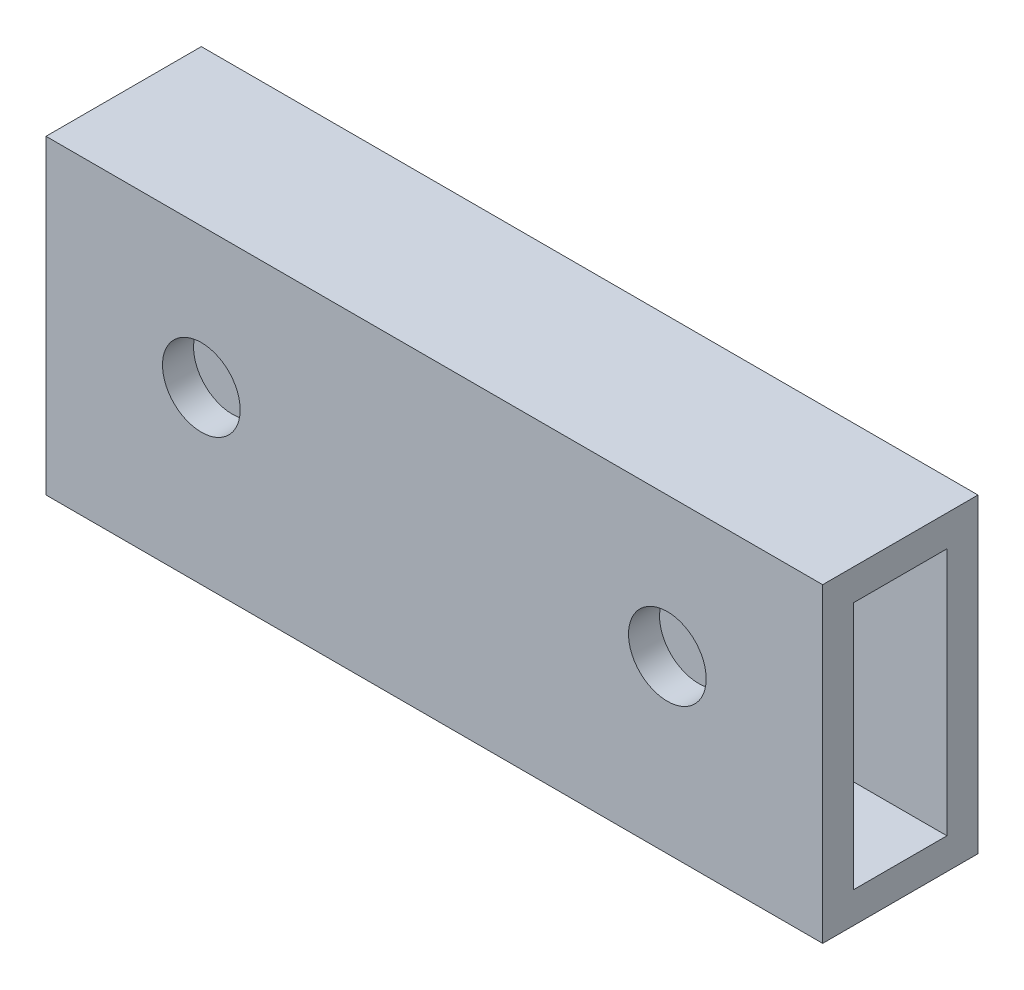
ISO-10303-21;
HEADER;
FILE_DESCRIPTION(('STEP AP214'),'2;1');
FILE_NAME('part.step','',(''),(''),'','','');
FILE_SCHEMA(('AUTOMOTIVE_DESIGN { 1 0 10303 214 1 1 1 1 }'));
ENDSEC;
DATA;
#1=APPLICATION_CONTEXT('core data for automotive mechanical design processes');
#2=APPLICATION_PROTOCOL_DEFINITION('international standard','automotive_design',2000,#1);
#3=PRODUCT_CONTEXT('',#1,'mechanical');
#4=PRODUCT('Part','Part','',(#3));
#5=PRODUCT_RELATED_PRODUCT_CATEGORY('part','',(#4));
#6=PRODUCT_DEFINITION_FORMATION('','',#4);
#7=PRODUCT_DEFINITION_CONTEXT('part definition',#1,'design');
#8=PRODUCT_DEFINITION('design','',#6,#7);
#9=PRODUCT_DEFINITION_SHAPE('','',#8);
#10=(LENGTH_UNIT() NAMED_UNIT(*) SI_UNIT(.MILLI.,.METRE.));
#11=(NAMED_UNIT(*) PLANE_ANGLE_UNIT() SI_UNIT($,.RADIAN.));
#12=(NAMED_UNIT(*) SI_UNIT($,.STERADIAN.) SOLID_ANGLE_UNIT());
#13=UNCERTAINTY_MEASURE_WITH_UNIT(LENGTH_MEASURE(1.E-05),#10,'distance_accuracy_value','');
#14=(GEOMETRIC_REPRESENTATION_CONTEXT(3) GLOBAL_UNCERTAINTY_ASSIGNED_CONTEXT((#13)) GLOBAL_UNIT_ASSIGNED_CONTEXT((#10,
#11,#12)) REPRESENTATION_CONTEXT('',''));
#15=CARTESIAN_POINT('',(0.,0.,0.));
#16=DIRECTION('',(0.,0.,1.));
#17=DIRECTION('',(1.,0.,0.));
#18=AXIS2_PLACEMENT_3D('',#15,#16,#17);
#19=CARTESIAN_POINT('',(-96.1386740943104,114.333988554593,10.));
#20=DIRECTION('',(1.,0.,0.));
#21=DIRECTION('',(0.,0.,-1.));
#22=AXIS2_PLACEMENT_3D('',#19,#20,#21);
#23=PLANE('',#22);
#24=DIRECTION('',(0.,0.,-1.));
#25=VECTOR('',#24,1.);
#26=CARTESIAN_POINT('',(-96.1386740943104,132.333988554593,8.));
#27=LINE('',#26,#25);
#28=CARTESIAN_POINT('',(-96.1386740943104,132.333988554593,8.));
#29=VERTEX_POINT('',#28);
#30=CARTESIAN_POINT('',(-96.1386740943104,132.333988554593,2.));
#31=VERTEX_POINT('',#30);
#32=EDGE_CURVE('E113',#29,#31,#27,.T.);
#33=ORIENTED_EDGE('',*,*,#32,.F.);
#34=DIRECTION('',(0.,1.,0.));
#35=VECTOR('',#34,1.);
#36=CARTESIAN_POINT('',(-96.1386740943104,132.333988554593,8.));
#37=LINE('',#36,#35);
#38=CARTESIAN_POINT('',(-96.1386740943104,116.333988554593,8.));
#39=VERTEX_POINT('',#38);
#40=EDGE_CURVE('E51',#39,#29,#37,.T.);
#41=ORIENTED_EDGE('',*,*,#40,.F.);
#42=DIRECTION('',(0.,0.,1.));
#43=VECTOR('',#42,1.);
#44=CARTESIAN_POINT('',(-96.1386740943104,116.333988554593,8.));
#45=LINE('',#44,#43);
#46=CARTESIAN_POINT('',(-96.1386740943104,116.333988554593,2.));
#47=VERTEX_POINT('',#46);
#48=EDGE_CURVE('E119',#47,#39,#45,.T.);
#49=ORIENTED_EDGE('',*,*,#48,.F.);
#50=DIRECTION('',(0.,-1.,0.));
#51=VECTOR('',#50,1.);
#52=CARTESIAN_POINT('',(-96.1386740943104,132.333988554593,2.));
#53=LINE('',#52,#51);
#54=EDGE_CURVE('E104',#31,#47,#53,.T.);
#55=ORIENTED_EDGE('',*,*,#54,.F.);
#56=EDGE_LOOP('',(#33,#41,#49,#55));
#57=FACE_BOUND('',#56,.T.);
#58=DIRECTION('',(0.,-1.,0.));
#59=VECTOR('',#58,1.);
#60=CARTESIAN_POINT('',(-96.1386740943104,114.333988554593,0.));
#61=LINE('',#60,#59);
#62=CARTESIAN_POINT('',(-96.1386740943104,134.333988554593,0.));
#63=VERTEX_POINT('',#62);
#64=CARTESIAN_POINT('',(-96.1386740943104,114.333988554593,0.));
#65=VERTEX_POINT('',#64);
#66=EDGE_CURVE('E126',#63,#65,#61,.T.);
#67=ORIENTED_EDGE('',*,*,#66,.T.);
#68=DIRECTION('',(0.,0.,-1.));
#69=VECTOR('',#68,1.);
#70=CARTESIAN_POINT('',(-96.1386740943104,114.333988554593,10.));
#71=LINE('',#70,#69);
#72=CARTESIAN_POINT('',(-96.1386740943104,114.333988554593,10.));
#73=VERTEX_POINT('',#72);
#74=EDGE_CURVE('E155',#73,#65,#71,.T.);
#75=ORIENTED_EDGE('',*,*,#74,.F.);
#76=DIRECTION('',(0.,-1.,0.));
#77=VECTOR('',#76,1.);
#78=CARTESIAN_POINT('',(-96.1386740943104,114.333988554593,10.));
#79=LINE('',#78,#77);
#80=CARTESIAN_POINT('',(-96.1386740943104,134.333988554593,10.));
#81=VERTEX_POINT('',#80);
#82=EDGE_CURVE('E129',#81,#73,#79,.T.);
#83=ORIENTED_EDGE('',*,*,#82,.F.);
#84=DIRECTION('',(0.,0.,-1.));
#85=VECTOR('',#84,1.);
#86=CARTESIAN_POINT('',(-96.1386740943104,134.333988554593,10.));
#87=LINE('',#86,#85);
#88=EDGE_CURVE('E139',#81,#63,#87,.T.);
#89=ORIENTED_EDGE('',*,*,#88,.T.);
#90=EDGE_LOOP('',(#67,#75,#83,#89));
#91=FACE_BOUND('',#90,.T.);
#92=ADVANCED_FACE('F35',(#57,#91),#23,.F.);
#93=CARTESIAN_POINT('',(-96.1386740943104,114.333988554593,10.));
#94=DIRECTION('',(0.,1.,0.));
#95=DIRECTION('',(0.,0.,1.));
#96=AXIS2_PLACEMENT_3D('',#93,#94,#95);
#97=PLANE('',#96);
#98=DIRECTION('',(1.,0.,0.));
#99=VECTOR('',#98,1.);
#100=CARTESIAN_POINT('',(-96.1386740943104,114.333988554593,0.));
#101=LINE('',#100,#99);
#102=CARTESIAN_POINT('',(-46.1386740943102,114.333988554593,0.));
#103=VERTEX_POINT('',#102);
#104=EDGE_CURVE('E142',#65,#103,#101,.T.);
#105=ORIENTED_EDGE('',*,*,#104,.T.);
#106=DIRECTION('',(0.,0.,-1.));
#107=VECTOR('',#106,1.);
#108=CARTESIAN_POINT('',(-46.1386740943102,114.333988554593,10.));
#109=LINE('',#108,#107);
#110=CARTESIAN_POINT('',(-46.1386740943102,114.333988554593,10.));
#111=VERTEX_POINT('',#110);
#112=EDGE_CURVE('E152',#111,#103,#109,.T.);
#113=ORIENTED_EDGE('',*,*,#112,.F.);
#114=DIRECTION('',(1.,0.,0.));
#115=VECTOR('',#114,1.);
#116=CARTESIAN_POINT('',(-96.1386740943104,114.333988554593,10.));
#117=LINE('',#116,#115);
#118=EDGE_CURVE('E132',#73,#111,#117,.T.);
#119=ORIENTED_EDGE('',*,*,#118,.F.);
#120=ORIENTED_EDGE('',*,*,#74,.T.);
#121=EDGE_LOOP('',(#105,#113,#119,#120));
#122=FACE_BOUND('',#121,.T.);
#123=ADVANCED_FACE('F214',(#122),#97,.F.);
#124=CARTESIAN_POINT('',(-46.1386740943102,114.333988554593,10.));
#125=DIRECTION('',(-1.,0.,0.));
#126=DIRECTION('',(0.,0.,1.));
#127=AXIS2_PLACEMENT_3D('',#124,#125,#126);
#128=PLANE('',#127);
#129=DIRECTION('',(0.,0.,1.));
#130=VECTOR('',#129,1.);
#131=CARTESIAN_POINT('',(-46.1386740943102,116.333988554593,10.));
#132=LINE('',#131,#130);
#133=CARTESIAN_POINT('',(-46.1386740943102,116.333988554593,2.));
#134=VERTEX_POINT('',#133);
#135=CARTESIAN_POINT('',(-46.1386740943102,116.333988554593,8.));
#136=VERTEX_POINT('',#135);
#137=EDGE_CURVE('E43',#134,#136,#132,.T.);
#138=ORIENTED_EDGE('',*,*,#137,.T.);
#139=DIRECTION('',(0.,1.,0.));
#140=VECTOR('',#139,1.);
#141=CARTESIAN_POINT('',(-46.1386740943102,114.333988554593,8.));
#142=LINE('',#141,#140);
#143=CARTESIAN_POINT('',(-46.1386740943102,132.333988554593,8.));
#144=VERTEX_POINT('',#143);
#145=EDGE_CURVE('E11',#136,#144,#142,.T.);
#146=ORIENTED_EDGE('',*,*,#145,.T.);
#147=DIRECTION('',(0.,0.,-1.));
#148=VECTOR('',#147,1.);
#149=CARTESIAN_POINT('',(-46.1386740943102,132.333988554593,10.));
#150=LINE('',#149,#148);
#151=CARTESIAN_POINT('',(-46.1386740943102,132.333988554593,2.));
#152=VERTEX_POINT('',#151);
#153=EDGE_CURVE('E158',#144,#152,#150,.T.);
#154=ORIENTED_EDGE('',*,*,#153,.T.);
#155=DIRECTION('',(0.,-1.,0.));
#156=VECTOR('',#155,1.);
#157=CARTESIAN_POINT('',(-46.1386740943102,114.333988554593,2.));
#158=LINE('',#157,#156);
#159=EDGE_CURVE('E107',#152,#134,#158,.T.);
#160=ORIENTED_EDGE('',*,*,#159,.T.);
#161=EDGE_LOOP('',(#138,#146,#154,#160));
#162=FACE_BOUND('',#161,.T.);
#163=DIRECTION('',(0.,1.,0.));
#164=VECTOR('',#163,1.);
#165=CARTESIAN_POINT('',(-46.1386740943102,114.333988554593,0.));
#166=LINE('',#165,#164);
#167=CARTESIAN_POINT('',(-46.1386740943102,134.333988554593,0.));
#168=VERTEX_POINT('',#167);
#169=EDGE_CURVE('E144',#103,#168,#166,.T.);
#170=ORIENTED_EDGE('',*,*,#169,.T.);
#171=DIRECTION('',(0.,0.,-1.));
#172=VECTOR('',#171,1.);
#173=CARTESIAN_POINT('',(-46.1386740943102,134.333988554593,10.));
#174=LINE('',#173,#172);
#175=CARTESIAN_POINT('',(-46.1386740943102,134.333988554593,10.));
#176=VERTEX_POINT('',#175);
#177=EDGE_CURVE('E149',#176,#168,#174,.T.);
#178=ORIENTED_EDGE('',*,*,#177,.F.);
#179=DIRECTION('',(0.,1.,0.));
#180=VECTOR('',#179,1.);
#181=CARTESIAN_POINT('',(-46.1386740943102,114.333988554593,10.));
#182=LINE('',#181,#180);
#183=EDGE_CURVE('E135',#111,#176,#182,.T.);
#184=ORIENTED_EDGE('',*,*,#183,.F.);
#185=ORIENTED_EDGE('',*,*,#112,.T.);
#186=EDGE_LOOP('',(#170,#178,#184,#185));
#187=FACE_BOUND('',#186,.T.);
#188=ADVANCED_FACE('F211',(#162,#187),#128,.F.);
#189=CARTESIAN_POINT('',(-96.1386740943104,134.333988554593,10.));
#190=DIRECTION('',(0.,-1.,0.));
#191=DIRECTION('',(0.,0.,-1.));
#192=AXIS2_PLACEMENT_3D('',#189,#190,#191);
#193=PLANE('',#192);
#194=DIRECTION('',(-1.,0.,0.));
#195=VECTOR('',#194,1.);
#196=CARTESIAN_POINT('',(-96.1386740943104,134.333988554593,0.));
#197=LINE('',#196,#195);
#198=EDGE_CURVE('E133',#168,#63,#197,.T.);
#199=ORIENTED_EDGE('',*,*,#198,.T.);
#200=ORIENTED_EDGE('',*,*,#88,.F.);
#201=DIRECTION('',(-1.,0.,0.));
#202=VECTOR('',#201,1.);
#203=CARTESIAN_POINT('',(-96.1386740943104,134.333988554593,10.));
#204=LINE('',#203,#202);
#205=EDGE_CURVE('E137',#176,#81,#204,.T.);
#206=ORIENTED_EDGE('',*,*,#205,.F.);
#207=ORIENTED_EDGE('',*,*,#177,.T.);
#208=EDGE_LOOP('',(#199,#200,#206,#207));
#209=FACE_BOUND('',#208,.T.);
#210=ADVANCED_FACE('F207',(#209),#193,.F.);
#211=CARTESIAN_POINT('',(0.,0.,10.));
#212=DIRECTION('',(0.,0.,-1.));
#213=DIRECTION('',(-1.,0.,0.));
#214=AXIS2_PLACEMENT_3D('',#211,#212,#213);
#215=PLANE('',#214);
#216=CARTESIAN_POINT('',(-56.1386740943101,125.333988554593,10.));
#217=DIRECTION('',(0.,0.,1.));
#218=DIRECTION('',(1.,0.,0.));
#219=AXIS2_PLACEMENT_3D('',#216,#217,#218);
#220=CIRCLE('',#219,2.4999999999999);
#221=CARTESIAN_POINT('',(-53.6386740943102,125.333988554593,10.));
#222=VERTEX_POINT('',#221);
#223=EDGE_CURVE('E165',#222,#222,#220,.T.);
#224=ORIENTED_EDGE('',*,*,#223,.F.);
#225=EDGE_LOOP('',(#224));
#226=FACE_BOUND('',#225,.T.);
#227=CARTESIAN_POINT('',(-86.1386740943104,125.333988554593,10.));
#228=DIRECTION('',(0.,0.,1.));
#229=DIRECTION('',(1.,0.,0.));
#230=AXIS2_PLACEMENT_3D('',#227,#228,#229);
#231=CIRCLE('',#230,2.4999999999999);
#232=CARTESIAN_POINT('',(-83.6386740943105,125.333988554593,10.));
#233=VERTEX_POINT('',#232);
#234=EDGE_CURVE('E172',#233,#233,#231,.T.);
#235=ORIENTED_EDGE('',*,*,#234,.F.);
#236=EDGE_LOOP('',(#235));
#237=FACE_BOUND('',#236,.T.);
#238=ORIENTED_EDGE('',*,*,#82,.T.);
#239=ORIENTED_EDGE('',*,*,#118,.T.);
#240=ORIENTED_EDGE('',*,*,#183,.T.);
#241=ORIENTED_EDGE('',*,*,#205,.T.);
#242=EDGE_LOOP('',(#238,#239,#240,#241));
#243=FACE_BOUND('',#242,.T.);
#244=ADVANCED_FACE('F195',(#226,#237,#243),#215,.F.);
#245=CARTESIAN_POINT('',(0.,0.,0.));
#246=DIRECTION('',(0.,0.,-1.));
#247=DIRECTION('',(-1.,0.,0.));
#248=AXIS2_PLACEMENT_3D('',#245,#246,#247);
#249=PLANE('',#248);
#250=CARTESIAN_POINT('',(-56.1386740943101,125.333988554593,0.));
#251=DIRECTION('',(0.,0.,-1.));
#252=DIRECTION('',(-1.,0.,0.));
#253=AXIS2_PLACEMENT_3D('',#250,#251,#252);
#254=CIRCLE('',#253,2.4999999999999);
#255=CARTESIAN_POINT('',(-58.63867409431,125.333988554593,0.));
#256=VERTEX_POINT('',#255);
#257=EDGE_CURVE('E184',#256,#256,#254,.T.);
#258=ORIENTED_EDGE('',*,*,#257,.F.);
#259=EDGE_LOOP('',(#258));
#260=FACE_BOUND('',#259,.T.);
#261=CARTESIAN_POINT('',(-86.1386740943104,125.333988554593,0.));
#262=DIRECTION('',(0.,0.,-1.));
#263=DIRECTION('',(-1.,0.,0.));
#264=AXIS2_PLACEMENT_3D('',#261,#262,#263);
#265=CIRCLE('',#264,2.4999999999999);
#266=CARTESIAN_POINT('',(-88.6386740943103,125.333988554593,0.));
#267=VERTEX_POINT('',#266);
#268=EDGE_CURVE('E169',#267,#267,#265,.T.);
#269=ORIENTED_EDGE('',*,*,#268,.F.);
#270=EDGE_LOOP('',(#269));
#271=FACE_BOUND('',#270,.T.);
#272=ORIENTED_EDGE('',*,*,#66,.F.);
#273=ORIENTED_EDGE('',*,*,#198,.F.);
#274=ORIENTED_EDGE('',*,*,#169,.F.);
#275=ORIENTED_EDGE('',*,*,#104,.F.);
#276=EDGE_LOOP('',(#272,#273,#274,#275));
#277=FACE_BOUND('',#276,.T.);
#278=ADVANCED_FACE('F191',(#260,#271,#277),#249,.T.);
#279=CARTESIAN_POINT('',(-36.1386740943104,132.333988554593,8.));
#280=DIRECTION('',(0.,0.,1.));
#281=DIRECTION('',(0.,-1.,0.));
#282=AXIS2_PLACEMENT_3D('',#279,#280,#281);
#283=PLANE('',#282);
#284=CARTESIAN_POINT('',(-56.1386740943101,125.333988554593,8.));
#285=DIRECTION('',(0.,0.,1.));
#286=DIRECTION('',(0.,-1.,0.));
#287=AXIS2_PLACEMENT_3D('',#284,#285,#286);
#288=CIRCLE('',#287,2.4999999999999);
#289=CARTESIAN_POINT('',(-56.1386740943101,122.833988554593,8.));
#290=VERTEX_POINT('',#289);
#291=EDGE_CURVE('E181',#290,#290,#288,.T.);
#292=ORIENTED_EDGE('',*,*,#291,.T.);
#293=EDGE_LOOP('',(#292));
#294=FACE_BOUND('',#293,.T.);
#295=CARTESIAN_POINT('',(-86.1386740943104,125.333988554593,8.));
#296=DIRECTION('',(0.,0.,1.));
#297=DIRECTION('',(0.,-1.,0.));
#298=AXIS2_PLACEMENT_3D('',#295,#296,#297);
#299=CIRCLE('',#298,2.4999999999999);
#300=CARTESIAN_POINT('',(-86.1386740943104,122.833988554593,8.));
#301=VERTEX_POINT('',#300);
#302=EDGE_CURVE('E164',#301,#301,#299,.T.);
#303=ORIENTED_EDGE('',*,*,#302,.T.);
#304=EDGE_LOOP('',(#303));
#305=FACE_BOUND('',#304,.T.);
#306=DIRECTION('',(-1.,0.,0.));
#307=VECTOR('',#306,1.);
#308=CARTESIAN_POINT('',(-36.1386740943104,116.333988554593,8.));
#309=LINE('',#308,#307);
#310=EDGE_CURVE('E124',#136,#39,#309,.T.);
#311=ORIENTED_EDGE('',*,*,#310,.T.);
#312=ORIENTED_EDGE('',*,*,#40,.T.);
#313=DIRECTION('',(-1.,0.,0.));
#314=VECTOR('',#313,1.);
#315=CARTESIAN_POINT('',(-36.1386740943104,132.333988554593,8.));
#316=LINE('',#315,#314);
#317=EDGE_CURVE('E110',#144,#29,#316,.T.);
#318=ORIENTED_EDGE('',*,*,#317,.F.);
#319=ORIENTED_EDGE('',*,*,#145,.F.);
#320=EDGE_LOOP('',(#311,#312,#318,#319));
#321=FACE_BOUND('',#320,.T.);
#322=ADVANCED_FACE('F194',(#294,#305,#321),#283,.F.);
#323=CARTESIAN_POINT('',(-36.1386740943104,116.333988554593,8.));
#324=DIRECTION('',(0.,-1.,0.));
#325=DIRECTION('',(0.,0.,-1.));
#326=AXIS2_PLACEMENT_3D('',#323,#324,#325);
#327=PLANE('',#326);
#328=DIRECTION('',(-1.,0.,0.));
#329=VECTOR('',#328,1.);
#330=CARTESIAN_POINT('',(-36.1386740943104,116.333988554593,2.));
#331=LINE('',#330,#329);
#332=EDGE_CURVE('E109',#134,#47,#331,.T.);
#333=ORIENTED_EDGE('',*,*,#332,.T.);
#334=ORIENTED_EDGE('',*,*,#48,.T.);
#335=ORIENTED_EDGE('',*,*,#310,.F.);
#336=ORIENTED_EDGE('',*,*,#137,.F.);
#337=EDGE_LOOP('',(#333,#334,#335,#336));
#338=FACE_BOUND('',#337,.T.);
#339=ADVANCED_FACE('F238',(#338),#327,.F.);
#340=CARTESIAN_POINT('',(-36.1386740943104,132.333988554593,2.));
#341=DIRECTION('',(0.,0.,-1.));
#342=DIRECTION('',(0.,1.,0.));
#343=AXIS2_PLACEMENT_3D('',#340,#341,#342);
#344=PLANE('',#343);
#345=CARTESIAN_POINT('',(-56.1386740943101,125.333988554593,2.));
#346=DIRECTION('',(0.,0.,-1.));
#347=DIRECTION('',(0.,1.,0.));
#348=AXIS2_PLACEMENT_3D('',#345,#346,#347);
#349=CIRCLE('',#348,2.4999999999999);
#350=CARTESIAN_POINT('',(-56.1386740943101,127.833988554593,2.));
#351=VERTEX_POINT('',#350);
#352=EDGE_CURVE('E38',#351,#351,#349,.T.);
#353=ORIENTED_EDGE('',*,*,#352,.T.);
#354=EDGE_LOOP('',(#353));
#355=FACE_BOUND('',#354,.T.);
#356=CARTESIAN_POINT('',(-86.1386740943104,125.333988554593,2.));
#357=DIRECTION('',(0.,0.,-1.));
#358=DIRECTION('',(0.,1.,0.));
#359=AXIS2_PLACEMENT_3D('',#356,#357,#358);
#360=CIRCLE('',#359,2.4999999999999);
#361=CARTESIAN_POINT('',(-86.1386740943104,127.833988554593,2.));
#362=VERTEX_POINT('',#361);
#363=EDGE_CURVE('E162',#362,#362,#360,.T.);
#364=ORIENTED_EDGE('',*,*,#363,.T.);
#365=EDGE_LOOP('',(#364));
#366=FACE_BOUND('',#365,.T.);
#367=DIRECTION('',(-1.,0.,0.));
#368=VECTOR('',#367,1.);
#369=CARTESIAN_POINT('',(-36.1386740943104,132.333988554593,2.));
#370=LINE('',#369,#368);
#371=EDGE_CURVE('E59',#152,#31,#370,.T.);
#372=ORIENTED_EDGE('',*,*,#371,.T.);
#373=ORIENTED_EDGE('',*,*,#54,.T.);
#374=ORIENTED_EDGE('',*,*,#332,.F.);
#375=ORIENTED_EDGE('',*,*,#159,.F.);
#376=EDGE_LOOP('',(#372,#373,#374,#375));
#377=FACE_BOUND('',#376,.T.);
#378=ADVANCED_FACE('F101',(#355,#366,#377),#344,.F.);
#379=CARTESIAN_POINT('',(-36.1386740943104,132.333988554593,8.));
#380=DIRECTION('',(0.,1.,0.));
#381=DIRECTION('',(0.,0.,1.));
#382=AXIS2_PLACEMENT_3D('',#379,#380,#381);
#383=PLANE('',#382);
#384=ORIENTED_EDGE('',*,*,#317,.T.);
#385=ORIENTED_EDGE('',*,*,#32,.T.);
#386=ORIENTED_EDGE('',*,*,#371,.F.);
#387=ORIENTED_EDGE('',*,*,#153,.F.);
#388=EDGE_LOOP('',(#384,#385,#386,#387));
#389=FACE_BOUND('',#388,.T.);
#390=ADVANCED_FACE('F114',(#389),#383,.F.);
#391=CARTESIAN_POINT('',(-86.1386740943104,125.333988554593,-20.));
#392=DIRECTION('',(0.,0.,1.));
#393=DIRECTION('',(1.,0.,0.));
#394=AXIS2_PLACEMENT_3D('',#391,#392,#393);
#395=CYLINDRICAL_SURFACE('',#394,2.4999999999999);
#396=ORIENTED_EDGE('',*,*,#268,.T.);
#397=EDGE_LOOP('',(#396));
#398=FACE_BOUND('',#397,.T.);
#399=ORIENTED_EDGE('',*,*,#363,.F.);
#400=EDGE_LOOP('',(#399));
#401=FACE_BOUND('',#400,.T.);
#402=ADVANCED_FACE('F249',(#398,#401),#395,.F.);
#403=CARTESIAN_POINT('',(-56.1386740943101,125.333988554593,-20.));
#404=DIRECTION('',(0.,0.,1.));
#405=DIRECTION('',(1.,0.,0.));
#406=AXIS2_PLACEMENT_3D('',#403,#404,#405);
#407=CYLINDRICAL_SURFACE('',#406,2.4999999999999);
#408=ORIENTED_EDGE('',*,*,#257,.T.);
#409=EDGE_LOOP('',(#408));
#410=FACE_BOUND('',#409,.T.);
#411=ORIENTED_EDGE('',*,*,#352,.F.);
#412=EDGE_LOOP('',(#411));
#413=FACE_BOUND('',#412,.T.);
#414=ADVANCED_FACE('F188',(#410,#413),#407,.F.);
#415=ORIENTED_EDGE('',*,*,#234,.T.);
#416=EDGE_LOOP('',(#415));
#417=FACE_BOUND('',#416,.T.);
#418=ORIENTED_EDGE('',*,*,#302,.F.);
#419=EDGE_LOOP('',(#418));
#420=FACE_BOUND('',#419,.T.);
#421=ADVANCED_FACE('F253',(#417,#420),#395,.F.);
#422=ORIENTED_EDGE('',*,*,#223,.T.);
#423=EDGE_LOOP('',(#422));
#424=FACE_BOUND('',#423,.T.);
#425=ORIENTED_EDGE('',*,*,#291,.F.);
#426=EDGE_LOOP('',(#425));
#427=FACE_BOUND('',#426,.T.);
#428=ADVANCED_FACE('F256',(#424,#427),#407,.F.);
#429=CLOSED_SHELL('',(#92,#123,#188,#210,#244,#278,#322,#339,#378,#390,#402,#414,#421,#428));
#430=MANIFOLD_SOLID_BREP('B2',#429);
#431=ADVANCED_BREP_SHAPE_REPRESENTATION('',(#18,#430),#14);
#432=SHAPE_DEFINITION_REPRESENTATION(#9,#431);
ENDSEC;
END-ISO-10303-21;
